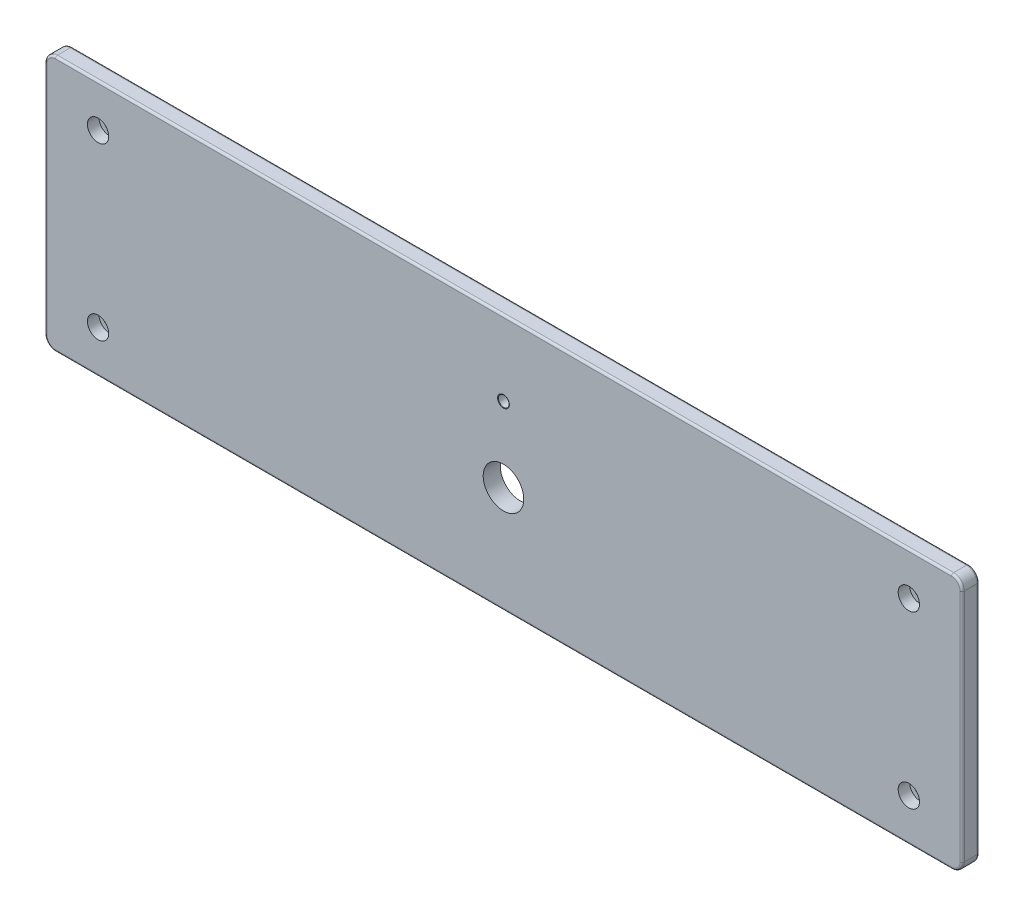
ISO-10303-21;
HEADER;
FILE_DESCRIPTION(('STEP AP214'),'2;1');
FILE_NAME('part.step','',(''),(''),'','','');
FILE_SCHEMA(('AUTOMOTIVE_DESIGN { 1 0 10303 214 1 1 1 1 }'));
ENDSEC;
DATA;
#1=APPLICATION_CONTEXT('core data for automotive mechanical design processes');
#2=APPLICATION_PROTOCOL_DEFINITION('international standard','automotive_design',2000,#1);
#3=PRODUCT_CONTEXT('',#1,'mechanical');
#4=PRODUCT('Part','Part','',(#3));
#5=PRODUCT_RELATED_PRODUCT_CATEGORY('part','',(#4));
#6=PRODUCT_DEFINITION_FORMATION('','',#4);
#7=PRODUCT_DEFINITION_CONTEXT('part definition',#1,'design');
#8=PRODUCT_DEFINITION('design','',#6,#7);
#9=PRODUCT_DEFINITION_SHAPE('','',#8);
#10=(LENGTH_UNIT() NAMED_UNIT(*) SI_UNIT(.MILLI.,.METRE.));
#11=(NAMED_UNIT(*) PLANE_ANGLE_UNIT() SI_UNIT($,.RADIAN.));
#12=(NAMED_UNIT(*) SI_UNIT($,.STERADIAN.) SOLID_ANGLE_UNIT());
#13=UNCERTAINTY_MEASURE_WITH_UNIT(LENGTH_MEASURE(1.E-05),#10,'distance_accuracy_value','');
#14=(GEOMETRIC_REPRESENTATION_CONTEXT(3) GLOBAL_UNCERTAINTY_ASSIGNED_CONTEXT((#13)) GLOBAL_UNIT_ASSIGNED_CONTEXT((#10,
#11,#12)) REPRESENTATION_CONTEXT('',''));
#15=CARTESIAN_POINT('',(0.,0.,0.));
#16=DIRECTION('',(0.,0.,1.));
#17=DIRECTION('',(1.,0.,0.));
#18=AXIS2_PLACEMENT_3D('',#15,#16,#17);
#19=CARTESIAN_POINT('',(0.,120.,0.));
#20=DIRECTION('',(0.,0.,-1.));
#21=DIRECTION('',(-1.,0.,0.));
#22=AXIS2_PLACEMENT_3D('',#19,#20,#21);
#23=PLANE('',#22);
#24=CARTESIAN_POINT('',(25.,100.,0.));
#25=DIRECTION('',(0.,0.,1.));
#26=DIRECTION('',(1.,0.,0.));
#27=AXIS2_PLACEMENT_3D('',#24,#25,#26);
#28=CIRCLE('',#27,2.75);
#29=CARTESIAN_POINT('',(27.75,100.,0.));
#30=VERTEX_POINT('',#29);
#31=EDGE_CURVE('E556',#30,#30,#28,.T.);
#32=ORIENTED_EDGE('',*,*,#31,.T.);
#33=EDGE_LOOP('',(#32));
#34=FACE_BOUND('',#33,.T.);
#35=CARTESIAN_POINT('',(405.,100.,0.));
#36=DIRECTION('',(0.,0.,1.));
#37=DIRECTION('',(1.,0.,0.));
#38=AXIS2_PLACEMENT_3D('',#35,#36,#37);
#39=CIRCLE('',#38,2.74999999999997);
#40=CARTESIAN_POINT('',(407.75,100.,0.));
#41=VERTEX_POINT('',#40);
#42=EDGE_CURVE('E575',#41,#41,#39,.T.);
#43=ORIENTED_EDGE('',*,*,#42,.T.);
#44=EDGE_LOOP('',(#43));
#45=FACE_BOUND('',#44,.T.);
#46=CARTESIAN_POINT('',(215.,50.,0.));
#47=DIRECTION('',(0.,0.,1.));
#48=DIRECTION('',(1.,0.,0.));
#49=AXIS2_PLACEMENT_3D('',#46,#47,#48);
#50=CIRCLE('',#49,9.50000000000001);
#51=CARTESIAN_POINT('',(224.5,50.,0.));
#52=VERTEX_POINT('',#51);
#53=EDGE_CURVE('E484',#52,#52,#50,.T.);
#54=ORIENTED_EDGE('',*,*,#53,.T.);
#55=EDGE_LOOP('',(#54));
#56=FACE_BOUND('',#55,.T.);
#57=CARTESIAN_POINT('',(215.,85.,0.));
#58=DIRECTION('',(0.,0.,1.));
#59=DIRECTION('',(1.,0.,0.));
#60=AXIS2_PLACEMENT_3D('',#57,#58,#59);
#61=CIRCLE('',#60,2.5);
#62=CARTESIAN_POINT('',(217.5,85.,0.));
#63=VERTEX_POINT('',#62);
#64=EDGE_CURVE('E255',#63,#63,#61,.T.);
#65=ORIENTED_EDGE('',*,*,#64,.T.);
#66=EDGE_LOOP('',(#65));
#67=FACE_BOUND('',#66,.T.);
#68=DIRECTION('',(1.,0.,0.));
#69=VECTOR('',#68,1.);
#70=CARTESIAN_POINT('',(5.,1.,0.));
#71=LINE('',#70,#69);
#72=CARTESIAN_POINT('',(425.,1.,0.));
#73=VERTEX_POINT('',#72);
#74=CARTESIAN_POINT('',(5.,1.,0.));
#75=VERTEX_POINT('',#74);
#76=EDGE_CURVE('E184',#73,#75,#71,.F.);
#77=ORIENTED_EDGE('',*,*,#76,.T.);
#78=CARTESIAN_POINT('',(5.,5.,0.));
#79=DIRECTION('',(0.,0.,-1.));
#80=DIRECTION('',(-1.,0.,0.));
#81=AXIS2_PLACEMENT_3D('',#78,#79,#80);
#82=CIRCLE('',#81,4.);
#83=CARTESIAN_POINT('',(1.,5.,0.));
#84=VERTEX_POINT('',#83);
#85=EDGE_CURVE('E186',#75,#84,#82,.T.);
#86=ORIENTED_EDGE('',*,*,#85,.T.);
#87=DIRECTION('',(0.,-1.,0.));
#88=VECTOR('',#87,1.);
#89=CARTESIAN_POINT('',(1.,115.,0.));
#90=LINE('',#89,#88);
#91=CARTESIAN_POINT('',(1.,115.,0.));
#92=VERTEX_POINT('',#91);
#93=EDGE_CURVE('E150',#84,#92,#90,.F.);
#94=ORIENTED_EDGE('',*,*,#93,.T.);
#95=CARTESIAN_POINT('',(5.,115.,0.));
#96=DIRECTION('',(0.,0.,-1.));
#97=DIRECTION('',(-1.,0.,0.));
#98=AXIS2_PLACEMENT_3D('',#95,#96,#97);
#99=CIRCLE('',#98,4.);
#100=CARTESIAN_POINT('',(5.,119.,0.));
#101=VERTEX_POINT('',#100);
#102=EDGE_CURVE('E143',#92,#101,#99,.T.);
#103=ORIENTED_EDGE('',*,*,#102,.T.);
#104=DIRECTION('',(-1.,0.,0.));
#105=VECTOR('',#104,1.);
#106=CARTESIAN_POINT('',(425.,119.,0.));
#107=LINE('',#106,#105);
#108=CARTESIAN_POINT('',(425.,119.,0.));
#109=VERTEX_POINT('',#108);
#110=EDGE_CURVE('E147',#101,#109,#107,.F.);
#111=ORIENTED_EDGE('',*,*,#110,.T.);
#112=CARTESIAN_POINT('',(425.,115.,0.));
#113=DIRECTION('',(0.,0.,-1.));
#114=DIRECTION('',(-1.,0.,0.));
#115=AXIS2_PLACEMENT_3D('',#112,#113,#114);
#116=CIRCLE('',#115,4.);
#117=CARTESIAN_POINT('',(429.,115.,0.));
#118=VERTEX_POINT('',#117);
#119=EDGE_CURVE('E155',#109,#118,#116,.T.);
#120=ORIENTED_EDGE('',*,*,#119,.T.);
#121=DIRECTION('',(0.,1.,0.));
#122=VECTOR('',#121,1.);
#123=CARTESIAN_POINT('',(429.,5.,0.));
#124=LINE('',#123,#122);
#125=CARTESIAN_POINT('',(429.,5.,0.));
#126=VERTEX_POINT('',#125);
#127=EDGE_CURVE('E154',#118,#126,#124,.F.);
#128=ORIENTED_EDGE('',*,*,#127,.T.);
#129=CARTESIAN_POINT('',(425.,5.,0.));
#130=DIRECTION('',(0.,0.,-1.));
#131=DIRECTION('',(-1.,0.,0.));
#132=AXIS2_PLACEMENT_3D('',#129,#130,#131);
#133=CIRCLE('',#132,4.);
#134=EDGE_CURVE('E181',#126,#73,#133,.T.);
#135=ORIENTED_EDGE('',*,*,#134,.T.);
#136=EDGE_LOOP('',(#77,#86,#94,#103,#111,#120,#128,#135));
#137=FACE_BOUND('',#136,.T.);
#138=CARTESIAN_POINT('',(405.,20.,0.));
#139=DIRECTION('',(0.,0.,1.));
#140=DIRECTION('',(1.,0.,0.));
#141=AXIS2_PLACEMENT_3D('',#138,#139,#140);
#142=CIRCLE('',#141,2.74999999999997);
#143=CARTESIAN_POINT('',(407.75,20.,0.));
#144=VERTEX_POINT('',#143);
#145=EDGE_CURVE('E565',#144,#144,#142,.T.);
#146=ORIENTED_EDGE('',*,*,#145,.T.);
#147=EDGE_LOOP('',(#146));
#148=FACE_BOUND('',#147,.T.);
#149=CARTESIAN_POINT('',(25.,20.,0.));
#150=DIRECTION('',(0.,0.,1.));
#151=DIRECTION('',(1.,0.,0.));
#152=AXIS2_PLACEMENT_3D('',#149,#150,#151);
#153=CIRCLE('',#152,2.75);
#154=CARTESIAN_POINT('',(27.75,20.,0.));
#155=VERTEX_POINT('',#154);
#156=EDGE_CURVE('E545',#155,#155,#153,.T.);
#157=ORIENTED_EDGE('',*,*,#156,.T.);
#158=EDGE_LOOP('',(#157));
#159=FACE_BOUND('',#158,.T.);
#160=ADVANCED_FACE('F33',(#34,#45,#56,#67,#137,#148,#159),#23,.T.);
#161=CARTESIAN_POINT('',(0.,0.,8.));
#162=DIRECTION('',(1.,0.,0.));
#163=DIRECTION('',(0.,0.,-1.));
#164=AXIS2_PLACEMENT_3D('',#161,#162,#163);
#165=PLANE('',#164);
#166=DIRECTION('',(0.,0.,-1.));
#167=VECTOR('',#166,1.);
#168=CARTESIAN_POINT('',(0.,115.,8.));
#169=LINE('',#168,#167);
#170=CARTESIAN_POINT('',(0.,115.,7.));
#171=VERTEX_POINT('',#170);
#172=CARTESIAN_POINT('',(0.,115.,1.));
#173=VERTEX_POINT('',#172);
#174=EDGE_CURVE('E410',#171,#173,#169,.T.);
#175=ORIENTED_EDGE('',*,*,#174,.T.);
#176=DIRECTION('',(0.,-1.,0.));
#177=VECTOR('',#176,1.);
#178=CARTESIAN_POINT('',(0.,5.,1.));
#179=LINE('',#178,#177);
#180=CARTESIAN_POINT('',(0.,5.,1.));
#181=VERTEX_POINT('',#180);
#182=EDGE_CURVE('E199',#173,#181,#179,.T.);
#183=ORIENTED_EDGE('',*,*,#182,.T.);
#184=DIRECTION('',(0.,0.,-1.));
#185=VECTOR('',#184,1.);
#186=CARTESIAN_POINT('',(0.,5.,8.));
#187=LINE('',#186,#185);
#188=CARTESIAN_POINT('',(0.,5.,7.));
#189=VERTEX_POINT('',#188);
#190=EDGE_CURVE('E413',#181,#189,#187,.F.);
#191=ORIENTED_EDGE('',*,*,#190,.T.);
#192=DIRECTION('',(0.,-1.,0.));
#193=VECTOR('',#192,1.);
#194=CARTESIAN_POINT('',(0.,0.,7.));
#195=LINE('',#194,#193);
#196=EDGE_CURVE('E197',#189,#171,#195,.F.);
#197=ORIENTED_EDGE('',*,*,#196,.T.);
#198=EDGE_LOOP('',(#175,#183,#191,#197));
#199=FACE_BOUND('',#198,.T.);
#200=ADVANCED_FACE('F294',(#199),#165,.F.);
#201=CARTESIAN_POINT('',(0.,0.,8.));
#202=DIRECTION('',(0.,1.,0.));
#203=DIRECTION('',(0.,0.,1.));
#204=AXIS2_PLACEMENT_3D('',#201,#202,#203);
#205=PLANE('',#204);
#206=DIRECTION('',(0.,0.,-1.));
#207=VECTOR('',#206,1.);
#208=CARTESIAN_POINT('',(5.,0.,8.));
#209=LINE('',#208,#207);
#210=CARTESIAN_POINT('',(5.,0.,7.));
#211=VERTEX_POINT('',#210);
#212=CARTESIAN_POINT('',(5.,0.,1.));
#213=VERTEX_POINT('',#212);
#214=EDGE_CURVE('E404',#211,#213,#209,.T.);
#215=ORIENTED_EDGE('',*,*,#214,.T.);
#216=DIRECTION('',(1.,0.,0.));
#217=VECTOR('',#216,1.);
#218=CARTESIAN_POINT('',(425.,0.,1.));
#219=LINE('',#218,#217);
#220=CARTESIAN_POINT('',(425.,0.,1.));
#221=VERTEX_POINT('',#220);
#222=EDGE_CURVE('E207',#213,#221,#219,.T.);
#223=ORIENTED_EDGE('',*,*,#222,.T.);
#224=DIRECTION('',(0.,0.,-1.));
#225=VECTOR('',#224,1.);
#226=CARTESIAN_POINT('',(425.,0.,8.));
#227=LINE('',#226,#225);
#228=CARTESIAN_POINT('',(425.,0.,7.));
#229=VERTEX_POINT('',#228);
#230=EDGE_CURVE('E164',#221,#229,#227,.F.);
#231=ORIENTED_EDGE('',*,*,#230,.T.);
#232=DIRECTION('',(1.,0.,0.));
#233=VECTOR('',#232,1.);
#234=CARTESIAN_POINT('',(0.,0.,7.));
#235=LINE('',#234,#233);
#236=EDGE_CURVE('E205',#229,#211,#235,.F.);
#237=ORIENTED_EDGE('',*,*,#236,.T.);
#238=EDGE_LOOP('',(#215,#223,#231,#237));
#239=FACE_BOUND('',#238,.T.);
#240=ADVANCED_FACE('F300',(#239),#205,.F.);
#241=CARTESIAN_POINT('',(430.,0.,8.));
#242=DIRECTION('',(-1.,0.,0.));
#243=DIRECTION('',(0.,0.,1.));
#244=AXIS2_PLACEMENT_3D('',#241,#242,#243);
#245=PLANE('',#244);
#246=DIRECTION('',(0.,0.,-1.));
#247=VECTOR('',#246,1.);
#248=CARTESIAN_POINT('',(430.,5.,8.));
#249=LINE('',#248,#247);
#250=CARTESIAN_POINT('',(430.,5.,7.));
#251=VERTEX_POINT('',#250);
#252=CARTESIAN_POINT('',(430.,5.,1.));
#253=VERTEX_POINT('',#252);
#254=EDGE_CURVE('E422',#251,#253,#249,.T.);
#255=ORIENTED_EDGE('',*,*,#254,.T.);
#256=DIRECTION('',(0.,1.,0.));
#257=VECTOR('',#256,1.);
#258=CARTESIAN_POINT('',(430.,115.,1.));
#259=LINE('',#258,#257);
#260=CARTESIAN_POINT('',(430.,115.,1.));
#261=VERTEX_POINT('',#260);
#262=EDGE_CURVE('E215',#253,#261,#259,.T.);
#263=ORIENTED_EDGE('',*,*,#262,.T.);
#264=DIRECTION('',(0.,0.,-1.));
#265=VECTOR('',#264,1.);
#266=CARTESIAN_POINT('',(430.,115.,8.));
#267=LINE('',#266,#265);
#268=CARTESIAN_POINT('',(430.,115.,7.));
#269=VERTEX_POINT('',#268);
#270=EDGE_CURVE('E419',#261,#269,#267,.F.);
#271=ORIENTED_EDGE('',*,*,#270,.T.);
#272=DIRECTION('',(0.,1.,0.));
#273=VECTOR('',#272,1.);
#274=CARTESIAN_POINT('',(430.,0.,7.));
#275=LINE('',#274,#273);
#276=EDGE_CURVE('E213',#269,#251,#275,.F.);
#277=ORIENTED_EDGE('',*,*,#276,.T.);
#278=EDGE_LOOP('',(#255,#263,#271,#277));
#279=FACE_BOUND('',#278,.T.);
#280=ADVANCED_FACE('F312',(#279),#245,.F.);
#281=CARTESIAN_POINT('',(0.,120.,8.));
#282=DIRECTION('',(0.,-1.,0.));
#283=DIRECTION('',(0.,0.,-1.));
#284=AXIS2_PLACEMENT_3D('',#281,#282,#283);
#285=PLANE('',#284);
#286=DIRECTION('',(0.,0.,-1.));
#287=VECTOR('',#286,1.);
#288=CARTESIAN_POINT('',(425.,120.,8.));
#289=LINE('',#288,#287);
#290=CARTESIAN_POINT('',(425.,120.,7.));
#291=VERTEX_POINT('',#290);
#292=CARTESIAN_POINT('',(425.,120.,1.));
#293=VERTEX_POINT('',#292);
#294=EDGE_CURVE('E171',#291,#293,#289,.T.);
#295=ORIENTED_EDGE('',*,*,#294,.T.);
#296=DIRECTION('',(-1.,0.,0.));
#297=VECTOR('',#296,1.);
#298=CARTESIAN_POINT('',(5.,120.,1.));
#299=LINE('',#298,#297);
#300=CARTESIAN_POINT('',(5.,120.,1.));
#301=VERTEX_POINT('',#300);
#302=EDGE_CURVE('E234',#293,#301,#299,.T.);
#303=ORIENTED_EDGE('',*,*,#302,.T.);
#304=DIRECTION('',(0.,0.,-1.));
#305=VECTOR('',#304,1.);
#306=CARTESIAN_POINT('',(5.,120.,8.));
#307=LINE('',#306,#305);
#308=CARTESIAN_POINT('',(5.,120.,7.));
#309=VERTEX_POINT('',#308);
#310=EDGE_CURVE('E175',#301,#309,#307,.F.);
#311=ORIENTED_EDGE('',*,*,#310,.T.);
#312=DIRECTION('',(-1.,0.,0.));
#313=VECTOR('',#312,1.);
#314=CARTESIAN_POINT('',(0.,120.,7.));
#315=LINE('',#314,#313);
#316=EDGE_CURVE('E232',#309,#291,#315,.F.);
#317=ORIENTED_EDGE('',*,*,#316,.T.);
#318=EDGE_LOOP('',(#295,#303,#311,#317));
#319=FACE_BOUND('',#318,.T.);
#320=ADVANCED_FACE('F309',(#319),#285,.F.);
#321=CARTESIAN_POINT('',(0.,120.,8.));
#322=DIRECTION('',(0.,0.,-1.));
#323=DIRECTION('',(-1.,0.,0.));
#324=AXIS2_PLACEMENT_3D('',#321,#322,#323);
#325=PLANE('',#324);
#326=CARTESIAN_POINT('',(25.,20.,8.));
#327=DIRECTION('',(0.,0.,1.));
#328=DIRECTION('',(1.,0.,0.));
#329=AXIS2_PLACEMENT_3D('',#326,#327,#328);
#330=CIRCLE('',#329,4.99999999999999);
#331=CARTESIAN_POINT('',(30.,20.,8.));
#332=VERTEX_POINT('',#331);
#333=EDGE_CURVE('E466',#332,#332,#330,.T.);
#334=ORIENTED_EDGE('',*,*,#333,.F.);
#335=EDGE_LOOP('',(#334));
#336=FACE_BOUND('',#335,.T.);
#337=CARTESIAN_POINT('',(25.,100.,8.));
#338=DIRECTION('',(0.,0.,1.));
#339=DIRECTION('',(1.,0.,0.));
#340=AXIS2_PLACEMENT_3D('',#337,#338,#339);
#341=CIRCLE('',#340,4.99999999999999);
#342=CARTESIAN_POINT('',(30.,100.,8.));
#343=VERTEX_POINT('',#342);
#344=EDGE_CURVE('E470',#343,#343,#341,.T.);
#345=ORIENTED_EDGE('',*,*,#344,.F.);
#346=EDGE_LOOP('',(#345));
#347=FACE_BOUND('',#346,.T.);
#348=CARTESIAN_POINT('',(405.,20.,8.));
#349=DIRECTION('',(0.,0.,1.));
#350=DIRECTION('',(1.,0.,0.));
#351=AXIS2_PLACEMENT_3D('',#348,#349,#350);
#352=CIRCLE('',#351,5.);
#353=CARTESIAN_POINT('',(410.,20.,8.));
#354=VERTEX_POINT('',#353);
#355=EDGE_CURVE('E474',#354,#354,#352,.T.);
#356=ORIENTED_EDGE('',*,*,#355,.F.);
#357=EDGE_LOOP('',(#356));
#358=FACE_BOUND('',#357,.T.);
#359=CARTESIAN_POINT('',(405.,100.,8.));
#360=DIRECTION('',(0.,0.,1.));
#361=DIRECTION('',(1.,0.,0.));
#362=AXIS2_PLACEMENT_3D('',#359,#360,#361);
#363=CIRCLE('',#362,5.);
#364=CARTESIAN_POINT('',(410.,100.,8.));
#365=VERTEX_POINT('',#364);
#366=EDGE_CURVE('E478',#365,#365,#363,.T.);
#367=ORIENTED_EDGE('',*,*,#366,.F.);
#368=EDGE_LOOP('',(#367));
#369=FACE_BOUND('',#368,.T.);
#370=CARTESIAN_POINT('',(215.,85.,8.));
#371=DIRECTION('',(0.,0.,-1.));
#372=DIRECTION('',(-1.,0.,0.));
#373=AXIS2_PLACEMENT_3D('',#370,#371,#372);
#374=CIRCLE('',#373,2.74999999999995);
#375=CARTESIAN_POINT('',(212.25,85.,8.));
#376=VERTEX_POINT('',#375);
#377=EDGE_CURVE('E11',#376,#376,#374,.T.);
#378=ORIENTED_EDGE('',*,*,#377,.T.);
#379=EDGE_LOOP('',(#378));
#380=FACE_BOUND('',#379,.T.);
#381=CARTESIAN_POINT('',(215.,50.,8.));
#382=DIRECTION('',(0.,0.,1.));
#383=DIRECTION('',(1.,0.,0.));
#384=AXIS2_PLACEMENT_3D('',#381,#382,#383);
#385=CIRCLE('',#384,9.49999999999998);
#386=CARTESIAN_POINT('',(224.5,50.,8.));
#387=VERTEX_POINT('',#386);
#388=EDGE_CURVE('E482',#387,#387,#385,.T.);
#389=ORIENTED_EDGE('',*,*,#388,.F.);
#390=EDGE_LOOP('',(#389));
#391=FACE_BOUND('',#390,.T.);
#392=CARTESIAN_POINT('',(425.,5.,8.));
#393=DIRECTION('',(0.,0.,-1.));
#394=DIRECTION('',(-1.,0.,0.));
#395=AXIS2_PLACEMENT_3D('',#392,#393,#394);
#396=CIRCLE('',#395,4.);
#397=CARTESIAN_POINT('',(425.,1.,8.));
#398=VERTEX_POINT('',#397);
#399=CARTESIAN_POINT('',(429.,5.,8.));
#400=VERTEX_POINT('',#399);
#401=EDGE_CURVE('E48',#398,#400,#396,.F.);
#402=ORIENTED_EDGE('',*,*,#401,.T.);
#403=DIRECTION('',(0.,1.,0.));
#404=VECTOR('',#403,1.);
#405=CARTESIAN_POINT('',(429.,120.,8.));
#406=LINE('',#405,#404);
#407=CARTESIAN_POINT('',(429.,115.,8.));
#408=VERTEX_POINT('',#407);
#409=EDGE_CURVE('E230',#400,#408,#406,.T.);
#410=ORIENTED_EDGE('',*,*,#409,.T.);
#411=CARTESIAN_POINT('',(425.,115.,8.));
#412=DIRECTION('',(0.,0.,-1.));
#413=DIRECTION('',(-1.,0.,0.));
#414=AXIS2_PLACEMENT_3D('',#411,#412,#413);
#415=CIRCLE('',#414,4.);
#416=CARTESIAN_POINT('',(425.,119.,8.));
#417=VERTEX_POINT('',#416);
#418=EDGE_CURVE('E219',#408,#417,#415,.F.);
#419=ORIENTED_EDGE('',*,*,#418,.T.);
#420=DIRECTION('',(-1.,0.,0.));
#421=VECTOR('',#420,1.);
#422=CARTESIAN_POINT('',(0.,119.,8.));
#423=LINE('',#422,#421);
#424=CARTESIAN_POINT('',(5.,119.,8.));
#425=VERTEX_POINT('',#424);
#426=EDGE_CURVE('E217',#417,#425,#423,.T.);
#427=ORIENTED_EDGE('',*,*,#426,.T.);
#428=CARTESIAN_POINT('',(5.,115.,8.));
#429=DIRECTION('',(0.,0.,-1.));
#430=DIRECTION('',(-1.,0.,0.));
#431=AXIS2_PLACEMENT_3D('',#428,#429,#430);
#432=CIRCLE('',#431,4.);
#433=CARTESIAN_POINT('',(1.,115.,8.));
#434=VERTEX_POINT('',#433);
#435=EDGE_CURVE('E221',#425,#434,#432,.F.);
#436=ORIENTED_EDGE('',*,*,#435,.T.);
#437=DIRECTION('',(0.,-1.,0.));
#438=VECTOR('',#437,1.);
#439=CARTESIAN_POINT('',(1.,120.,8.));
#440=LINE('',#439,#438);
#441=CARTESIAN_POINT('',(1.,5.,8.));
#442=VERTEX_POINT('',#441);
#443=EDGE_CURVE('E224',#434,#442,#440,.T.);
#444=ORIENTED_EDGE('',*,*,#443,.T.);
#445=CARTESIAN_POINT('',(5.,5.,8.));
#446=DIRECTION('',(0.,0.,-1.));
#447=DIRECTION('',(-1.,0.,0.));
#448=AXIS2_PLACEMENT_3D('',#445,#446,#447);
#449=CIRCLE('',#448,4.);
#450=CARTESIAN_POINT('',(5.,1.,8.));
#451=VERTEX_POINT('',#450);
#452=EDGE_CURVE('E226',#442,#451,#449,.F.);
#453=ORIENTED_EDGE('',*,*,#452,.T.);
#454=DIRECTION('',(1.,0.,0.));
#455=VECTOR('',#454,1.);
#456=CARTESIAN_POINT('',(0.,1.,8.));
#457=LINE('',#456,#455);
#458=EDGE_CURVE('E53',#451,#398,#457,.T.);
#459=ORIENTED_EDGE('',*,*,#458,.T.);
#460=EDGE_LOOP('',(#402,#410,#419,#427,#436,#444,#453,#459));
#461=FACE_BOUND('',#460,.T.);
#462=ADVANCED_FACE('F307',(#336,#347,#358,#369,#380,#391,#461),#325,.F.);
#463=CARTESIAN_POINT('',(5.,5.,8.));
#464=DIRECTION('',(0.,0.,-1.));
#465=DIRECTION('',(-1.,0.,0.));
#466=AXIS2_PLACEMENT_3D('',#463,#464,#465);
#467=CYLINDRICAL_SURFACE('',#466,5.);
#468=ORIENTED_EDGE('',*,*,#190,.F.);
#469=CARTESIAN_POINT('',(5.,5.,1.));
#470=DIRECTION('',(0.,0.,-1.));
#471=DIRECTION('',(-1.,0.,0.));
#472=AXIS2_PLACEMENT_3D('',#469,#470,#471);
#473=CIRCLE('',#472,5.);
#474=EDGE_CURVE('E203',#181,#213,#473,.F.);
#475=ORIENTED_EDGE('',*,*,#474,.T.);
#476=ORIENTED_EDGE('',*,*,#214,.F.);
#477=CARTESIAN_POINT('',(5.,5.,7.));
#478=DIRECTION('',(0.,0.,-1.));
#479=DIRECTION('',(-1.,0.,0.));
#480=AXIS2_PLACEMENT_3D('',#477,#478,#479);
#481=CIRCLE('',#480,5.);
#482=EDGE_CURVE('E201',#211,#189,#481,.T.);
#483=ORIENTED_EDGE('',*,*,#482,.T.);
#484=EDGE_LOOP('',(#468,#475,#476,#483));
#485=FACE_BOUND('',#484,.T.);
#486=ADVANCED_FACE('F320',(#485),#467,.T.);
#487=CARTESIAN_POINT('',(425.,5.,8.));
#488=DIRECTION('',(0.,0.,-1.));
#489=DIRECTION('',(-1.,0.,0.));
#490=AXIS2_PLACEMENT_3D('',#487,#488,#489);
#491=CYLINDRICAL_SURFACE('',#490,5.);
#492=ORIENTED_EDGE('',*,*,#230,.F.);
#493=CARTESIAN_POINT('',(425.,5.,1.));
#494=DIRECTION('',(0.,0.,-1.));
#495=DIRECTION('',(-1.,0.,0.));
#496=AXIS2_PLACEMENT_3D('',#493,#494,#495);
#497=CIRCLE('',#496,5.);
#498=EDGE_CURVE('E190',#221,#253,#497,.F.);
#499=ORIENTED_EDGE('',*,*,#498,.T.);
#500=ORIENTED_EDGE('',*,*,#254,.F.);
#501=CARTESIAN_POINT('',(425.,5.,7.));
#502=DIRECTION('',(0.,0.,-1.));
#503=DIRECTION('',(-1.,0.,0.));
#504=AXIS2_PLACEMENT_3D('',#501,#502,#503);
#505=CIRCLE('',#504,5.);
#506=EDGE_CURVE('E188',#251,#229,#505,.T.);
#507=ORIENTED_EDGE('',*,*,#506,.T.);
#508=EDGE_LOOP('',(#492,#499,#500,#507));
#509=FACE_BOUND('',#508,.T.);
#510=ADVANCED_FACE('F323',(#509),#491,.T.);
#511=CARTESIAN_POINT('',(425.,115.,8.));
#512=DIRECTION('',(0.,0.,-1.));
#513=DIRECTION('',(-1.,0.,0.));
#514=AXIS2_PLACEMENT_3D('',#511,#512,#513);
#515=CYLINDRICAL_SURFACE('',#514,5.);
#516=ORIENTED_EDGE('',*,*,#270,.F.);
#517=CARTESIAN_POINT('',(425.,115.,1.));
#518=DIRECTION('',(0.,0.,-1.));
#519=DIRECTION('',(-1.,0.,0.));
#520=AXIS2_PLACEMENT_3D('',#517,#518,#519);
#521=CIRCLE('',#520,5.);
#522=EDGE_CURVE('E211',#261,#293,#521,.F.);
#523=ORIENTED_EDGE('',*,*,#522,.T.);
#524=ORIENTED_EDGE('',*,*,#294,.F.);
#525=CARTESIAN_POINT('',(425.,115.,7.));
#526=DIRECTION('',(0.,0.,-1.));
#527=DIRECTION('',(-1.,0.,0.));
#528=AXIS2_PLACEMENT_3D('',#525,#526,#527);
#529=CIRCLE('',#528,5.);
#530=EDGE_CURVE('E209',#291,#269,#529,.T.);
#531=ORIENTED_EDGE('',*,*,#530,.T.);
#532=EDGE_LOOP('',(#516,#523,#524,#531));
#533=FACE_BOUND('',#532,.T.);
#534=ADVANCED_FACE('F327',(#533),#515,.T.);
#535=CARTESIAN_POINT('',(5.,115.,8.));
#536=DIRECTION('',(0.,0.,-1.));
#537=DIRECTION('',(-1.,0.,0.));
#538=AXIS2_PLACEMENT_3D('',#535,#536,#537);
#539=CYLINDRICAL_SURFACE('',#538,5.);
#540=ORIENTED_EDGE('',*,*,#310,.F.);
#541=CARTESIAN_POINT('',(5.,115.,1.));
#542=DIRECTION('',(0.,0.,-1.));
#543=DIRECTION('',(-1.,0.,0.));
#544=AXIS2_PLACEMENT_3D('',#541,#542,#543);
#545=CIRCLE('',#544,5.);
#546=EDGE_CURVE('E161',#301,#173,#545,.F.);
#547=ORIENTED_EDGE('',*,*,#546,.T.);
#548=ORIENTED_EDGE('',*,*,#174,.F.);
#549=CARTESIAN_POINT('',(5.,115.,7.));
#550=DIRECTION('',(0.,0.,-1.));
#551=DIRECTION('',(-1.,0.,0.));
#552=AXIS2_PLACEMENT_3D('',#549,#550,#551);
#553=CIRCLE('',#552,5.);
#554=EDGE_CURVE('E193',#171,#309,#553,.T.);
#555=ORIENTED_EDGE('',*,*,#554,.T.);
#556=EDGE_LOOP('',(#540,#547,#548,#555));
#557=FACE_BOUND('',#556,.T.);
#558=ADVANCED_FACE('F331',(#557),#539,.T.);
#559=CARTESIAN_POINT('',(5.,115.,1.));
#560=DIRECTION('',(0.,0.,-1.));
#561=DIRECTION('',(-1.,0.,0.));
#562=AXIS2_PLACEMENT_3D('',#559,#560,#561);
#563=TOROIDAL_SURFACE('',#562,4.,1.);
#564=CARTESIAN_POINT('',(1.,115.,1.));
#565=DIRECTION('',(0.,-1.,0.));
#566=DIRECTION('',(0.,0.,-1.));
#567=AXIS2_PLACEMENT_3D('',#564,#565,#566);
#568=CIRCLE('',#567,1.);
#569=EDGE_CURVE('E165',#173,#92,#568,.T.);
#570=ORIENTED_EDGE('',*,*,#569,.F.);
#571=ORIENTED_EDGE('',*,*,#546,.F.);
#572=CARTESIAN_POINT('',(5.,119.,1.));
#573=DIRECTION('',(1.,0.,0.));
#574=DIRECTION('',(0.,0.,-1.));
#575=AXIS2_PLACEMENT_3D('',#572,#573,#574);
#576=CIRCLE('',#575,1.);
#577=EDGE_CURVE('E159',#101,#301,#576,.T.);
#578=ORIENTED_EDGE('',*,*,#577,.F.);
#579=ORIENTED_EDGE('',*,*,#102,.F.);
#580=EDGE_LOOP('',(#570,#571,#578,#579));
#581=FACE_BOUND('',#580,.T.);
#582=ADVANCED_FACE('F160',(#581),#563,.T.);
#583=CARTESIAN_POINT('',(0.,119.,1.));
#584=DIRECTION('',(1.,0.,0.));
#585=DIRECTION('',(0.,0.,-1.));
#586=AXIS2_PLACEMENT_3D('',#583,#584,#585);
#587=CYLINDRICAL_SURFACE('',#586,1.);
#588=ORIENTED_EDGE('',*,*,#577,.T.);
#589=ORIENTED_EDGE('',*,*,#302,.F.);
#590=CARTESIAN_POINT('',(425.,119.,1.));
#591=DIRECTION('',(1.,0.,0.));
#592=DIRECTION('',(0.,0.,-1.));
#593=AXIS2_PLACEMENT_3D('',#590,#591,#592);
#594=CIRCLE('',#593,1.);
#595=EDGE_CURVE('E169',#109,#293,#594,.T.);
#596=ORIENTED_EDGE('',*,*,#595,.F.);
#597=ORIENTED_EDGE('',*,*,#110,.F.);
#598=EDGE_LOOP('',(#588,#589,#596,#597));
#599=FACE_BOUND('',#598,.T.);
#600=ADVANCED_FACE('F167',(#599),#587,.T.);
#601=CARTESIAN_POINT('',(1.,0.,1.));
#602=DIRECTION('',(0.,1.,0.));
#603=DIRECTION('',(0.,0.,1.));
#604=AXIS2_PLACEMENT_3D('',#601,#602,#603);
#605=CYLINDRICAL_SURFACE('',#604,1.);
#606=ORIENTED_EDGE('',*,*,#569,.T.);
#607=ORIENTED_EDGE('',*,*,#93,.F.);
#608=CARTESIAN_POINT('',(1.,5.,1.));
#609=DIRECTION('',(0.,-1.,0.));
#610=DIRECTION('',(0.,0.,-1.));
#611=AXIS2_PLACEMENT_3D('',#608,#609,#610);
#612=CIRCLE('',#611,1.);
#613=EDGE_CURVE('E247',#181,#84,#612,.T.);
#614=ORIENTED_EDGE('',*,*,#613,.F.);
#615=ORIENTED_EDGE('',*,*,#182,.F.);
#616=EDGE_LOOP('',(#606,#607,#614,#615));
#617=FACE_BOUND('',#616,.T.);
#618=ADVANCED_FACE('F356',(#617),#605,.T.);
#619=CARTESIAN_POINT('',(425.,115.,1.));
#620=DIRECTION('',(0.,0.,-1.));
#621=DIRECTION('',(-1.,0.,0.));
#622=AXIS2_PLACEMENT_3D('',#619,#620,#621);
#623=TOROIDAL_SURFACE('',#622,4.,1.);
#624=ORIENTED_EDGE('',*,*,#595,.T.);
#625=ORIENTED_EDGE('',*,*,#522,.F.);
#626=CARTESIAN_POINT('',(429.,115.,1.));
#627=DIRECTION('',(0.,-1.,0.));
#628=DIRECTION('',(0.,0.,-1.));
#629=AXIS2_PLACEMENT_3D('',#626,#627,#628);
#630=CIRCLE('',#629,1.);
#631=EDGE_CURVE('E244',#118,#261,#630,.T.);
#632=ORIENTED_EDGE('',*,*,#631,.F.);
#633=ORIENTED_EDGE('',*,*,#119,.F.);
#634=EDGE_LOOP('',(#624,#625,#632,#633));
#635=FACE_BOUND('',#634,.T.);
#636=ADVANCED_FACE('F352',(#635),#623,.T.);
#637=CARTESIAN_POINT('',(5.,5.,1.));
#638=DIRECTION('',(0.,0.,-1.));
#639=DIRECTION('',(-1.,0.,0.));
#640=AXIS2_PLACEMENT_3D('',#637,#638,#639);
#641=TOROIDAL_SURFACE('',#640,4.,1.);
#642=ORIENTED_EDGE('',*,*,#613,.T.);
#643=ORIENTED_EDGE('',*,*,#85,.F.);
#644=CARTESIAN_POINT('',(5.,1.,1.));
#645=DIRECTION('',(1.,0.,0.));
#646=DIRECTION('',(0.,0.,-1.));
#647=AXIS2_PLACEMENT_3D('',#644,#645,#646);
#648=CIRCLE('',#647,1.);
#649=EDGE_CURVE('E241',#213,#75,#648,.T.);
#650=ORIENTED_EDGE('',*,*,#649,.F.);
#651=ORIENTED_EDGE('',*,*,#474,.F.);
#652=EDGE_LOOP('',(#642,#643,#650,#651));
#653=FACE_BOUND('',#652,.T.);
#654=ADVANCED_FACE('F348',(#653),#641,.T.);
#655=CARTESIAN_POINT('',(429.,0.,1.));
#656=DIRECTION('',(0.,-1.,0.));
#657=DIRECTION('',(0.,0.,-1.));
#658=AXIS2_PLACEMENT_3D('',#655,#656,#657);
#659=CYLINDRICAL_SURFACE('',#658,1.);
#660=ORIENTED_EDGE('',*,*,#631,.T.);
#661=ORIENTED_EDGE('',*,*,#262,.F.);
#662=CARTESIAN_POINT('',(429.,5.,1.));
#663=DIRECTION('',(0.,-1.,0.));
#664=DIRECTION('',(0.,0.,-1.));
#665=AXIS2_PLACEMENT_3D('',#662,#663,#664);
#666=CIRCLE('',#665,1.);
#667=EDGE_CURVE('E238',#126,#253,#666,.T.);
#668=ORIENTED_EDGE('',*,*,#667,.F.);
#669=ORIENTED_EDGE('',*,*,#127,.F.);
#670=EDGE_LOOP('',(#660,#661,#668,#669));
#671=FACE_BOUND('',#670,.T.);
#672=ADVANCED_FACE('F344',(#671),#659,.T.);
#673=CARTESIAN_POINT('',(0.,1.,1.));
#674=DIRECTION('',(-1.,0.,0.));
#675=DIRECTION('',(0.,0.,1.));
#676=AXIS2_PLACEMENT_3D('',#673,#674,#675);
#677=CYLINDRICAL_SURFACE('',#676,1.);
#678=ORIENTED_EDGE('',*,*,#649,.T.);
#679=ORIENTED_EDGE('',*,*,#76,.F.);
#680=CARTESIAN_POINT('',(425.,1.,1.));
#681=DIRECTION('',(1.,0.,0.));
#682=DIRECTION('',(0.,0.,-1.));
#683=AXIS2_PLACEMENT_3D('',#680,#681,#682);
#684=CIRCLE('',#683,1.);
#685=EDGE_CURVE('E236',#221,#73,#684,.T.);
#686=ORIENTED_EDGE('',*,*,#685,.F.);
#687=ORIENTED_EDGE('',*,*,#222,.F.);
#688=EDGE_LOOP('',(#678,#679,#686,#687));
#689=FACE_BOUND('',#688,.T.);
#690=ADVANCED_FACE('F340',(#689),#677,.T.);
#691=CARTESIAN_POINT('',(425.,5.,1.));
#692=DIRECTION('',(0.,0.,-1.));
#693=DIRECTION('',(-1.,0.,0.));
#694=AXIS2_PLACEMENT_3D('',#691,#692,#693);
#695=TOROIDAL_SURFACE('',#694,4.,1.);
#696=ORIENTED_EDGE('',*,*,#667,.T.);
#697=ORIENTED_EDGE('',*,*,#498,.F.);
#698=ORIENTED_EDGE('',*,*,#685,.T.);
#699=ORIENTED_EDGE('',*,*,#134,.F.);
#700=EDGE_LOOP('',(#696,#697,#698,#699));
#701=FACE_BOUND('',#700,.T.);
#702=ADVANCED_FACE('F336',(#701),#695,.T.);
#703=CARTESIAN_POINT('',(425.,5.,7.));
#704=DIRECTION('',(0.,0.,-1.));
#705=DIRECTION('',(-1.,0.,0.));
#706=AXIS2_PLACEMENT_3D('',#703,#704,#705);
#707=TOROIDAL_SURFACE('',#706,4.,1.);
#708=CARTESIAN_POINT('',(425.,1.,7.));
#709=DIRECTION('',(-1.,0.,0.));
#710=DIRECTION('',(0.,0.,1.));
#711=AXIS2_PLACEMENT_3D('',#708,#709,#710);
#712=CIRCLE('',#711,1.);
#713=EDGE_CURVE('E269',#229,#398,#712,.T.);
#714=ORIENTED_EDGE('',*,*,#713,.F.);
#715=ORIENTED_EDGE('',*,*,#506,.F.);
#716=CARTESIAN_POINT('',(429.,5.,7.));
#717=DIRECTION('',(0.,1.,0.));
#718=DIRECTION('',(0.,0.,1.));
#719=AXIS2_PLACEMENT_3D('',#716,#717,#718);
#720=CIRCLE('',#719,1.);
#721=EDGE_CURVE('E239',#400,#251,#720,.T.);
#722=ORIENTED_EDGE('',*,*,#721,.F.);
#723=ORIENTED_EDGE('',*,*,#401,.F.);
#724=EDGE_LOOP('',(#714,#715,#722,#723));
#725=FACE_BOUND('',#724,.T.);
#726=ADVANCED_FACE('F339',(#725),#707,.T.);
#727=CARTESIAN_POINT('',(429.,120.,7.));
#728=DIRECTION('',(0.,1.,0.));
#729=DIRECTION('',(0.,0.,1.));
#730=AXIS2_PLACEMENT_3D('',#727,#728,#729);
#731=CYLINDRICAL_SURFACE('',#730,1.);
#732=ORIENTED_EDGE('',*,*,#721,.T.);
#733=ORIENTED_EDGE('',*,*,#276,.F.);
#734=CARTESIAN_POINT('',(429.,115.,7.));
#735=DIRECTION('',(0.,1.,0.));
#736=DIRECTION('',(0.,0.,1.));
#737=AXIS2_PLACEMENT_3D('',#734,#735,#736);
#738=CIRCLE('',#737,1.);
#739=EDGE_CURVE('E266',#408,#269,#738,.T.);
#740=ORIENTED_EDGE('',*,*,#739,.F.);
#741=ORIENTED_EDGE('',*,*,#409,.F.);
#742=EDGE_LOOP('',(#732,#733,#740,#741));
#743=FACE_BOUND('',#742,.T.);
#744=ADVANCED_FACE('F388',(#743),#731,.T.);
#745=CARTESIAN_POINT('',(0.,1.,7.));
#746=DIRECTION('',(1.,0.,0.));
#747=DIRECTION('',(0.,0.,-1.));
#748=AXIS2_PLACEMENT_3D('',#745,#746,#747);
#749=CYLINDRICAL_SURFACE('',#748,1.);
#750=ORIENTED_EDGE('',*,*,#713,.T.);
#751=ORIENTED_EDGE('',*,*,#458,.F.);
#752=CARTESIAN_POINT('',(5.,1.,7.));
#753=DIRECTION('',(-1.,0.,0.));
#754=DIRECTION('',(0.,0.,1.));
#755=AXIS2_PLACEMENT_3D('',#752,#753,#754);
#756=CIRCLE('',#755,1.);
#757=EDGE_CURVE('E263',#211,#451,#756,.T.);
#758=ORIENTED_EDGE('',*,*,#757,.F.);
#759=ORIENTED_EDGE('',*,*,#236,.F.);
#760=EDGE_LOOP('',(#750,#751,#758,#759));
#761=FACE_BOUND('',#760,.T.);
#762=ADVANCED_FACE('F384',(#761),#749,.T.);
#763=CARTESIAN_POINT('',(425.,115.,7.));
#764=DIRECTION('',(0.,0.,-1.));
#765=DIRECTION('',(-1.,0.,0.));
#766=AXIS2_PLACEMENT_3D('',#763,#764,#765);
#767=TOROIDAL_SURFACE('',#766,4.,1.);
#768=ORIENTED_EDGE('',*,*,#739,.T.);
#769=ORIENTED_EDGE('',*,*,#530,.F.);
#770=CARTESIAN_POINT('',(425.,119.,7.));
#771=DIRECTION('',(-1.,0.,0.));
#772=DIRECTION('',(0.,0.,1.));
#773=AXIS2_PLACEMENT_3D('',#770,#771,#772);
#774=CIRCLE('',#773,1.);
#775=EDGE_CURVE('E260',#417,#291,#774,.T.);
#776=ORIENTED_EDGE('',*,*,#775,.F.);
#777=ORIENTED_EDGE('',*,*,#418,.F.);
#778=EDGE_LOOP('',(#768,#769,#776,#777));
#779=FACE_BOUND('',#778,.T.);
#780=ADVANCED_FACE('F380',(#779),#767,.T.);
#781=CARTESIAN_POINT('',(5.,5.,7.));
#782=DIRECTION('',(0.,0.,-1.));
#783=DIRECTION('',(-1.,0.,0.));
#784=AXIS2_PLACEMENT_3D('',#781,#782,#783);
#785=TOROIDAL_SURFACE('',#784,4.,1.);
#786=ORIENTED_EDGE('',*,*,#757,.T.);
#787=ORIENTED_EDGE('',*,*,#452,.F.);
#788=CARTESIAN_POINT('',(1.,5.,7.));
#789=DIRECTION('',(0.,1.,0.));
#790=DIRECTION('',(0.,0.,1.));
#791=AXIS2_PLACEMENT_3D('',#788,#789,#790);
#792=CIRCLE('',#791,1.);
#793=EDGE_CURVE('E257',#189,#442,#792,.T.);
#794=ORIENTED_EDGE('',*,*,#793,.F.);
#795=ORIENTED_EDGE('',*,*,#482,.F.);
#796=EDGE_LOOP('',(#786,#787,#794,#795));
#797=FACE_BOUND('',#796,.T.);
#798=ADVANCED_FACE('F376',(#797),#785,.T.);
#799=CARTESIAN_POINT('',(0.,119.,7.));
#800=DIRECTION('',(-1.,0.,0.));
#801=DIRECTION('',(0.,0.,1.));
#802=AXIS2_PLACEMENT_3D('',#799,#800,#801);
#803=CYLINDRICAL_SURFACE('',#802,1.);
#804=ORIENTED_EDGE('',*,*,#775,.T.);
#805=ORIENTED_EDGE('',*,*,#316,.F.);
#806=CARTESIAN_POINT('',(5.,119.,7.));
#807=DIRECTION('',(-1.,0.,0.));
#808=DIRECTION('',(0.,0.,1.));
#809=AXIS2_PLACEMENT_3D('',#806,#807,#808);
#810=CIRCLE('',#809,1.);
#811=EDGE_CURVE('E254',#425,#309,#810,.T.);
#812=ORIENTED_EDGE('',*,*,#811,.F.);
#813=ORIENTED_EDGE('',*,*,#426,.F.);
#814=EDGE_LOOP('',(#804,#805,#812,#813));
#815=FACE_BOUND('',#814,.T.);
#816=ADVANCED_FACE('F372',(#815),#803,.T.);
#817=CARTESIAN_POINT('',(1.,120.,7.));
#818=DIRECTION('',(0.,-1.,0.));
#819=DIRECTION('',(0.,0.,-1.));
#820=AXIS2_PLACEMENT_3D('',#817,#818,#819);
#821=CYLINDRICAL_SURFACE('',#820,1.);
#822=ORIENTED_EDGE('',*,*,#793,.T.);
#823=ORIENTED_EDGE('',*,*,#443,.F.);
#824=CARTESIAN_POINT('',(1.,115.,7.));
#825=DIRECTION('',(0.,1.,0.));
#826=DIRECTION('',(0.,0.,1.));
#827=AXIS2_PLACEMENT_3D('',#824,#825,#826);
#828=CIRCLE('',#827,1.);
#829=EDGE_CURVE('E252',#171,#434,#828,.T.);
#830=ORIENTED_EDGE('',*,*,#829,.F.);
#831=ORIENTED_EDGE('',*,*,#196,.F.);
#832=EDGE_LOOP('',(#822,#823,#830,#831));
#833=FACE_BOUND('',#832,.T.);
#834=ADVANCED_FACE('F368',(#833),#821,.T.);
#835=CARTESIAN_POINT('',(5.,115.,7.));
#836=DIRECTION('',(0.,0.,-1.));
#837=DIRECTION('',(-1.,0.,0.));
#838=AXIS2_PLACEMENT_3D('',#835,#836,#837);
#839=TOROIDAL_SURFACE('',#838,4.,1.);
#840=ORIENTED_EDGE('',*,*,#811,.T.);
#841=ORIENTED_EDGE('',*,*,#554,.F.);
#842=ORIENTED_EDGE('',*,*,#829,.T.);
#843=ORIENTED_EDGE('',*,*,#435,.F.);
#844=EDGE_LOOP('',(#840,#841,#842,#843));
#845=FACE_BOUND('',#844,.T.);
#846=ADVANCED_FACE('F365',(#845),#839,.T.);
#847=CARTESIAN_POINT('',(215.,85.,8.));
#848=DIRECTION('',(0.,0.,1.));
#849=DIRECTION('',(1.,0.,0.));
#850=AXIS2_PLACEMENT_3D('',#847,#848,#849);
#851=CYLINDRICAL_SURFACE('',#850,2.49999999999999);
#852=CARTESIAN_POINT('',(215.,85.,7.85566243270261));
#853=DIRECTION('',(0.,0.,-1.));
#854=DIRECTION('',(-1.,0.,0.));
#855=AXIS2_PLACEMENT_3D('',#852,#853,#854);
#856=CIRCLE('',#855,2.49999999999999);
#857=CARTESIAN_POINT('',(212.5,85.,7.85566243270261));
#858=VERTEX_POINT('',#857);
#859=EDGE_CURVE('E41',#858,#858,#856,.F.);
#860=ORIENTED_EDGE('',*,*,#859,.T.);
#861=EDGE_LOOP('',(#860));
#862=FACE_BOUND('',#861,.T.);
#863=ORIENTED_EDGE('',*,*,#64,.F.);
#864=EDGE_LOOP('',(#863));
#865=FACE_BOUND('',#864,.T.);
#866=ADVANCED_FACE('F276',(#862,#865),#851,.F.);
#867=CARTESIAN_POINT('',(215.,50.,8.));
#868=DIRECTION('',(0.,0.,1.));
#869=DIRECTION('',(1.,0.,0.));
#870=AXIS2_PLACEMENT_3D('',#867,#868,#869);
#871=CYLINDRICAL_SURFACE('',#870,9.49999999999999);
#872=ORIENTED_EDGE('',*,*,#53,.F.);
#873=EDGE_LOOP('',(#872));
#874=FACE_BOUND('',#873,.T.);
#875=ORIENTED_EDGE('',*,*,#388,.T.);
#876=EDGE_LOOP('',(#875));
#877=FACE_BOUND('',#876,.T.);
#878=ADVANCED_FACE('F281',(#874,#877),#871,.F.);
#879=CARTESIAN_POINT('',(215.,85.,7.85566243270261));
#880=DIRECTION('',(0.,0.,1.));
#881=DIRECTION('',(1.,0.,0.));
#882=AXIS2_PLACEMENT_3D('',#879,#880,#881);
#883=CONICAL_SURFACE('',#882,2.49999999999999,1.04719755119656);
#884=ORIENTED_EDGE('',*,*,#377,.F.);
#885=EDGE_LOOP('',(#884));
#886=FACE_BOUND('',#885,.T.);
#887=ORIENTED_EDGE('',*,*,#859,.F.);
#888=EDGE_LOOP('',(#887));
#889=FACE_BOUND('',#888,.T.);
#890=ADVANCED_FACE('F35',(#886,#889),#883,.F.);
#891=CARTESIAN_POINT('',(405.,100.,8.));
#892=DIRECTION('',(0.,0.,1.));
#893=DIRECTION('',(1.,0.,0.));
#894=AXIS2_PLACEMENT_3D('',#891,#892,#893);
#895=CYLINDRICAL_SURFACE('',#894,5.);
#896=CARTESIAN_POINT('',(405.,100.,2.6));
#897=DIRECTION('',(0.,0.,1.));
#898=DIRECTION('',(1.,0.,0.));
#899=AXIS2_PLACEMENT_3D('',#896,#897,#898);
#900=CIRCLE('',#899,5.);
#901=CARTESIAN_POINT('',(410.,100.,2.6));
#902=VERTEX_POINT('',#901);
#903=EDGE_CURVE('E488',#902,#902,#900,.T.);
#904=ORIENTED_EDGE('',*,*,#903,.F.);
#905=EDGE_LOOP('',(#904));
#906=FACE_BOUND('',#905,.T.);
#907=ORIENTED_EDGE('',*,*,#366,.T.);
#908=EDGE_LOOP('',(#907));
#909=FACE_BOUND('',#908,.T.);
#910=ADVANCED_FACE('F280',(#906,#909),#895,.F.);
#911=CARTESIAN_POINT('',(407.75,100.,2.6));
#912=DIRECTION('',(0.,0.,-1.));
#913=DIRECTION('',(-1.,0.,0.));
#914=AXIS2_PLACEMENT_3D('',#911,#912,#913);
#915=PLANE('',#914);
#916=CARTESIAN_POINT('',(405.,100.,2.6));
#917=DIRECTION('',(0.,0.,1.));
#918=DIRECTION('',(1.,0.,0.));
#919=AXIS2_PLACEMENT_3D('',#916,#917,#918);
#920=CIRCLE('',#919,2.74999999999997);
#921=CARTESIAN_POINT('',(407.75,100.,2.6));
#922=VERTEX_POINT('',#921);
#923=EDGE_CURVE('E578',#922,#922,#920,.T.);
#924=ORIENTED_EDGE('',*,*,#923,.F.);
#925=EDGE_LOOP('',(#924));
#926=FACE_BOUND('',#925,.T.);
#927=ORIENTED_EDGE('',*,*,#903,.T.);
#928=EDGE_LOOP('',(#927));
#929=FACE_BOUND('',#928,.T.);
#930=ADVANCED_FACE('F287',(#926,#929),#915,.F.);
#931=CARTESIAN_POINT('',(405.,100.,8.));
#932=DIRECTION('',(0.,0.,1.));
#933=DIRECTION('',(1.,0.,0.));
#934=AXIS2_PLACEMENT_3D('',#931,#932,#933);
#935=CYLINDRICAL_SURFACE('',#934,2.74999999999997);
#936=ORIENTED_EDGE('',*,*,#42,.F.);
#937=EDGE_LOOP('',(#936));
#938=FACE_BOUND('',#937,.T.);
#939=ORIENTED_EDGE('',*,*,#923,.T.);
#940=EDGE_LOOP('',(#939));
#941=FACE_BOUND('',#940,.T.);
#942=ADVANCED_FACE('F500',(#938,#941),#935,.F.);
#943=CARTESIAN_POINT('',(405.,20.,8.));
#944=DIRECTION('',(0.,0.,1.));
#945=DIRECTION('',(1.,0.,0.));
#946=AXIS2_PLACEMENT_3D('',#943,#944,#945);
#947=CYLINDRICAL_SURFACE('',#946,5.);
#948=CARTESIAN_POINT('',(405.,20.,2.6));
#949=DIRECTION('',(0.,0.,1.));
#950=DIRECTION('',(1.,0.,0.));
#951=AXIS2_PLACEMENT_3D('',#948,#949,#950);
#952=CIRCLE('',#951,5.);
#953=CARTESIAN_POINT('',(410.,20.,2.6));
#954=VERTEX_POINT('',#953);
#955=EDGE_CURVE('E571',#954,#954,#952,.T.);
#956=ORIENTED_EDGE('',*,*,#955,.F.);
#957=EDGE_LOOP('',(#956));
#958=FACE_BOUND('',#957,.T.);
#959=ORIENTED_EDGE('',*,*,#355,.T.);
#960=EDGE_LOOP('',(#959));
#961=FACE_BOUND('',#960,.T.);
#962=ADVANCED_FACE('F504',(#958,#961),#947,.F.);
#963=CARTESIAN_POINT('',(407.75,20.,2.6));
#964=DIRECTION('',(0.,0.,-1.));
#965=DIRECTION('',(-1.,0.,0.));
#966=AXIS2_PLACEMENT_3D('',#963,#964,#965);
#967=PLANE('',#966);
#968=CARTESIAN_POINT('',(405.,20.,2.6));
#969=DIRECTION('',(0.,0.,1.));
#970=DIRECTION('',(1.,0.,0.));
#971=AXIS2_PLACEMENT_3D('',#968,#969,#970);
#972=CIRCLE('',#971,2.74999999999997);
#973=CARTESIAN_POINT('',(407.75,20.,2.6));
#974=VERTEX_POINT('',#973);
#975=EDGE_CURVE('E568',#974,#974,#972,.T.);
#976=ORIENTED_EDGE('',*,*,#975,.F.);
#977=EDGE_LOOP('',(#976));
#978=FACE_BOUND('',#977,.T.);
#979=ORIENTED_EDGE('',*,*,#955,.T.);
#980=EDGE_LOOP('',(#979));
#981=FACE_BOUND('',#980,.T.);
#982=ADVANCED_FACE('F508',(#978,#981),#967,.F.);
#983=CARTESIAN_POINT('',(405.,20.,8.));
#984=DIRECTION('',(0.,0.,1.));
#985=DIRECTION('',(1.,0.,0.));
#986=AXIS2_PLACEMENT_3D('',#983,#984,#985);
#987=CYLINDRICAL_SURFACE('',#986,2.74999999999997);
#988=ORIENTED_EDGE('',*,*,#145,.F.);
#989=EDGE_LOOP('',(#988));
#990=FACE_BOUND('',#989,.T.);
#991=ORIENTED_EDGE('',*,*,#975,.T.);
#992=EDGE_LOOP('',(#991));
#993=FACE_BOUND('',#992,.T.);
#994=ADVANCED_FACE('F512',(#990,#993),#987,.F.);
#995=CARTESIAN_POINT('',(25.,100.,8.));
#996=DIRECTION('',(0.,0.,1.));
#997=DIRECTION('',(1.,0.,0.));
#998=AXIS2_PLACEMENT_3D('',#995,#996,#997);
#999=CYLINDRICAL_SURFACE('',#998,5.);
#1000=CARTESIAN_POINT('',(25.,100.,2.6));
#1001=DIRECTION('',(0.,0.,1.));
#1002=DIRECTION('',(1.,0.,0.));
#1003=AXIS2_PLACEMENT_3D('',#1000,#1001,#1002);
#1004=CIRCLE('',#1003,5.);
#1005=CARTESIAN_POINT('',(30.,100.,2.6));
#1006=VERTEX_POINT('',#1005);
#1007=EDGE_CURVE('E561',#1006,#1006,#1004,.T.);
#1008=ORIENTED_EDGE('',*,*,#1007,.F.);
#1009=EDGE_LOOP('',(#1008));
#1010=FACE_BOUND('',#1009,.T.);
#1011=ORIENTED_EDGE('',*,*,#344,.T.);
#1012=EDGE_LOOP('',(#1011));
#1013=FACE_BOUND('',#1012,.T.);
#1014=ADVANCED_FACE('F516',(#1010,#1013),#999,.F.);
#1015=CARTESIAN_POINT('',(27.75,100.,2.6));
#1016=DIRECTION('',(0.,0.,-1.));
#1017=DIRECTION('',(-1.,0.,0.));
#1018=AXIS2_PLACEMENT_3D('',#1015,#1016,#1017);
#1019=PLANE('',#1018);
#1020=CARTESIAN_POINT('',(25.,100.,2.6));
#1021=DIRECTION('',(0.,0.,1.));
#1022=DIRECTION('',(1.,0.,0.));
#1023=AXIS2_PLACEMENT_3D('',#1020,#1021,#1022);
#1024=CIRCLE('',#1023,2.75);
#1025=CARTESIAN_POINT('',(27.75,100.,2.6));
#1026=VERTEX_POINT('',#1025);
#1027=EDGE_CURVE('E558',#1026,#1026,#1024,.T.);
#1028=ORIENTED_EDGE('',*,*,#1027,.F.);
#1029=EDGE_LOOP('',(#1028));
#1030=FACE_BOUND('',#1029,.T.);
#1031=ORIENTED_EDGE('',*,*,#1007,.T.);
#1032=EDGE_LOOP('',(#1031));
#1033=FACE_BOUND('',#1032,.T.);
#1034=ADVANCED_FACE('F520',(#1030,#1033),#1019,.F.);
#1035=CARTESIAN_POINT('',(25.,100.,8.));
#1036=DIRECTION('',(0.,0.,1.));
#1037=DIRECTION('',(1.,0.,0.));
#1038=AXIS2_PLACEMENT_3D('',#1035,#1036,#1037);
#1039=CYLINDRICAL_SURFACE('',#1038,2.75);
#1040=ORIENTED_EDGE('',*,*,#31,.F.);
#1041=EDGE_LOOP('',(#1040));
#1042=FACE_BOUND('',#1041,.T.);
#1043=ORIENTED_EDGE('',*,*,#1027,.T.);
#1044=EDGE_LOOP('',(#1043));
#1045=FACE_BOUND('',#1044,.T.);
#1046=ADVANCED_FACE('F524',(#1042,#1045),#1039,.F.);
#1047=CARTESIAN_POINT('',(25.,20.,8.));
#1048=DIRECTION('',(0.,0.,1.));
#1049=DIRECTION('',(1.,0.,0.));
#1050=AXIS2_PLACEMENT_3D('',#1047,#1048,#1049);
#1051=CYLINDRICAL_SURFACE('',#1050,5.);
#1052=CARTESIAN_POINT('',(25.,20.,2.6));
#1053=DIRECTION('',(0.,0.,1.));
#1054=DIRECTION('',(1.,0.,0.));
#1055=AXIS2_PLACEMENT_3D('',#1052,#1053,#1054);
#1056=CIRCLE('',#1055,5.);
#1057=CARTESIAN_POINT('',(30.,20.,2.6));
#1058=VERTEX_POINT('',#1057);
#1059=EDGE_CURVE('E549',#1058,#1058,#1056,.T.);
#1060=ORIENTED_EDGE('',*,*,#1059,.F.);
#1061=EDGE_LOOP('',(#1060));
#1062=FACE_BOUND('',#1061,.T.);
#1063=ORIENTED_EDGE('',*,*,#333,.T.);
#1064=EDGE_LOOP('',(#1063));
#1065=FACE_BOUND('',#1064,.T.);
#1066=ADVANCED_FACE('F528',(#1062,#1065),#1051,.F.);
#1067=CARTESIAN_POINT('',(27.75,20.,2.6));
#1068=DIRECTION('',(0.,0.,-1.));
#1069=DIRECTION('',(-1.,0.,0.));
#1070=AXIS2_PLACEMENT_3D('',#1067,#1068,#1069);
#1071=PLANE('',#1070);
#1072=CARTESIAN_POINT('',(25.,20.,2.6));
#1073=DIRECTION('',(0.,0.,1.));
#1074=DIRECTION('',(1.,0.,0.));
#1075=AXIS2_PLACEMENT_3D('',#1072,#1073,#1074);
#1076=CIRCLE('',#1075,2.75);
#1077=CARTESIAN_POINT('',(27.75,20.,2.6));
#1078=VERTEX_POINT('',#1077);
#1079=EDGE_CURVE('E548',#1078,#1078,#1076,.T.);
#1080=ORIENTED_EDGE('',*,*,#1079,.F.);
#1081=EDGE_LOOP('',(#1080));
#1082=FACE_BOUND('',#1081,.T.);
#1083=ORIENTED_EDGE('',*,*,#1059,.T.);
#1084=EDGE_LOOP('',(#1083));
#1085=FACE_BOUND('',#1084,.T.);
#1086=ADVANCED_FACE('F532',(#1082,#1085),#1071,.F.);
#1087=CARTESIAN_POINT('',(25.,20.,8.));
#1088=DIRECTION('',(0.,0.,1.));
#1089=DIRECTION('',(1.,0.,0.));
#1090=AXIS2_PLACEMENT_3D('',#1087,#1088,#1089);
#1091=CYLINDRICAL_SURFACE('',#1090,2.75);
#1092=ORIENTED_EDGE('',*,*,#156,.F.);
#1093=EDGE_LOOP('',(#1092));
#1094=FACE_BOUND('',#1093,.T.);
#1095=ORIENTED_EDGE('',*,*,#1079,.T.);
#1096=EDGE_LOOP('',(#1095));
#1097=FACE_BOUND('',#1096,.T.);
#1098=ADVANCED_FACE('F536',(#1094,#1097),#1091,.F.);
#1099=CLOSED_SHELL('',(#160,#200,#240,#280,#320,#462,#486,#510,#534,#558,#582,#600,#618,#636,
#654,#672,#690,#702,#726,#744,#762,#780,#798,#816,#834,#846,#866,#878,#890,#910,#930,#942,#962,
#982,#994,#1014,#1034,#1046,#1066,#1086,#1098));
#1100=MANIFOLD_SOLID_BREP('B2',#1099);
#1101=ADVANCED_BREP_SHAPE_REPRESENTATION('',(#18,#1100),#14);
#1102=SHAPE_DEFINITION_REPRESENTATION(#9,#1101);
ENDSEC;
END-ISO-10303-21;
